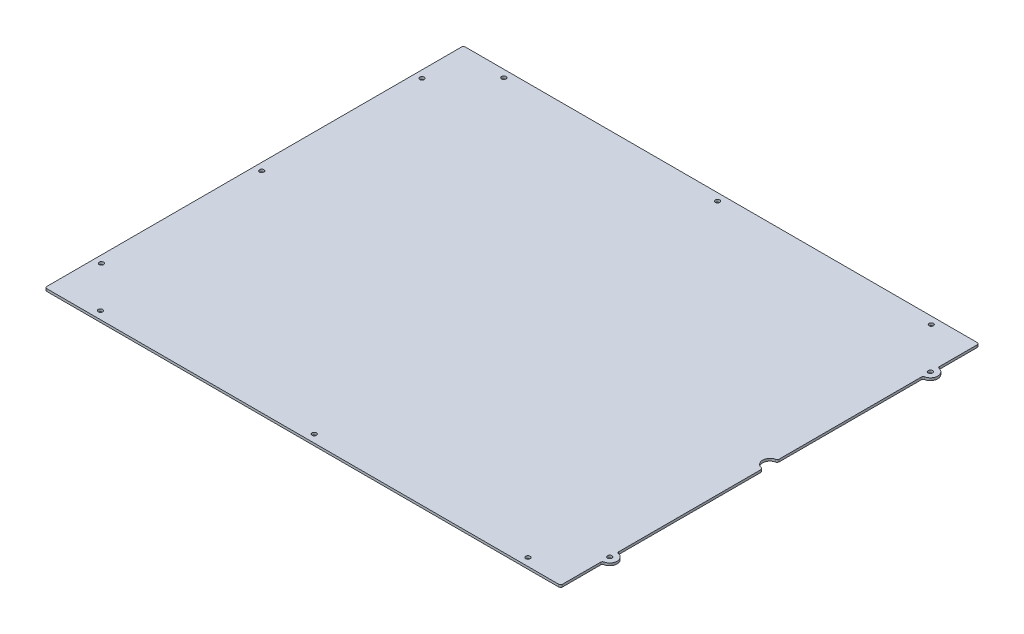
ISO-10303-21;
HEADER;
FILE_DESCRIPTION(('STEP AP214'),'2;1');
FILE_NAME('part.step','',(''),(''),'','','');
FILE_SCHEMA(('AUTOMOTIVE_DESIGN { 1 0 10303 214 1 1 1 1 }'));
ENDSEC;
DATA;
#1=APPLICATION_CONTEXT('core data for automotive mechanical design processes');
#2=APPLICATION_PROTOCOL_DEFINITION('international standard','automotive_design',2000,#1);
#3=PRODUCT_CONTEXT('',#1,'mechanical');
#4=PRODUCT('Part','Part','',(#3));
#5=PRODUCT_RELATED_PRODUCT_CATEGORY('part','',(#4));
#6=PRODUCT_DEFINITION_FORMATION('','',#4);
#7=PRODUCT_DEFINITION_CONTEXT('part definition',#1,'design');
#8=PRODUCT_DEFINITION('design','',#6,#7);
#9=PRODUCT_DEFINITION_SHAPE('','',#8);
#10=(LENGTH_UNIT() NAMED_UNIT(*) SI_UNIT(.MILLI.,.METRE.));
#11=(NAMED_UNIT(*) PLANE_ANGLE_UNIT() SI_UNIT($,.RADIAN.));
#12=(NAMED_UNIT(*) SI_UNIT($,.STERADIAN.) SOLID_ANGLE_UNIT());
#13=UNCERTAINTY_MEASURE_WITH_UNIT(LENGTH_MEASURE(1.E-05),#10,'distance_accuracy_value','');
#14=(GEOMETRIC_REPRESENTATION_CONTEXT(3) GLOBAL_UNCERTAINTY_ASSIGNED_CONTEXT((#13)) GLOBAL_UNIT_ASSIGNED_CONTEXT((#10,
#11,#12)) REPRESENTATION_CONTEXT('',''));
#15=CARTESIAN_POINT('',(0.,0.,0.));
#16=DIRECTION('',(0.,0.,1.));
#17=DIRECTION('',(1.,0.,0.));
#18=AXIS2_PLACEMENT_3D('',#15,#16,#17);
#19=CARTESIAN_POINT('',(-337.058,3.175,-273.558));
#20=DIRECTION('',(0.,0.,1.));
#21=DIRECTION('',(1.,0.,0.));
#22=AXIS2_PLACEMENT_3D('',#19,#20,#21);
#23=PLANE('',#22);
#24=DIRECTION('',(-1.,0.,0.));
#25=VECTOR('',#24,1.);
#26=CARTESIAN_POINT('',(-337.058,0.,-273.558));
#27=LINE('',#26,#25);
#28=CARTESIAN_POINT('',(334.518,0.,-273.558));
#29=VERTEX_POINT('',#28);
#30=CARTESIAN_POINT('',(-334.518,0.,-273.558));
#31=VERTEX_POINT('',#30);
#32=EDGE_CURVE('E198',#29,#31,#27,.T.);
#33=ORIENTED_EDGE('',*,*,#32,.T.);
#34=DIRECTION('',(0.,-1.,0.));
#35=VECTOR('',#34,1.);
#36=CARTESIAN_POINT('',(-334.518,3.175,-273.558));
#37=LINE('',#36,#35);
#38=CARTESIAN_POINT('',(-334.518,3.175,-273.558));
#39=VERTEX_POINT('',#38);
#40=EDGE_CURVE('E176',#31,#39,#37,.F.);
#41=ORIENTED_EDGE('',*,*,#40,.T.);
#42=DIRECTION('',(-1.,0.,0.));
#43=VECTOR('',#42,1.);
#44=CARTESIAN_POINT('',(-337.058,3.175,-273.558));
#45=LINE('',#44,#43);
#46=CARTESIAN_POINT('',(334.518,3.175,-273.558));
#47=VERTEX_POINT('',#46);
#48=EDGE_CURVE('E226',#47,#39,#45,.T.);
#49=ORIENTED_EDGE('',*,*,#48,.F.);
#50=DIRECTION('',(0.,-1.,0.));
#51=VECTOR('',#50,1.);
#52=CARTESIAN_POINT('',(334.518,3.175,-273.558));
#53=LINE('',#52,#51);
#54=EDGE_CURVE('E181',#47,#29,#53,.T.);
#55=ORIENTED_EDGE('',*,*,#54,.T.);
#56=EDGE_LOOP('',(#33,#41,#49,#55));
#57=FACE_BOUND('',#56,.T.);
#58=ADVANCED_FACE('F34',(#57),#23,.F.);
#59=CARTESIAN_POINT('',(-337.058,3.175,273.558));
#60=DIRECTION('',(1.,0.,0.));
#61=DIRECTION('',(0.,0.,-1.));
#62=AXIS2_PLACEMENT_3D('',#59,#60,#61);
#63=PLANE('',#62);
#64=DIRECTION('',(0.,0.,1.));
#65=VECTOR('',#64,1.);
#66=CARTESIAN_POINT('',(-337.058,3.175,273.558));
#67=LINE('',#66,#65);
#68=CARTESIAN_POINT('',(-337.058,3.175,-271.018));
#69=VERTEX_POINT('',#68);
#70=CARTESIAN_POINT('',(-337.058,3.175,271.018));
#71=VERTEX_POINT('',#70);
#72=EDGE_CURVE('E191',#69,#71,#67,.T.);
#73=ORIENTED_EDGE('',*,*,#72,.F.);
#74=DIRECTION('',(0.,-1.,0.));
#75=VECTOR('',#74,1.);
#76=CARTESIAN_POINT('',(-337.058,3.175,-271.018));
#77=LINE('',#76,#75);
#78=CARTESIAN_POINT('',(-337.058,0.,-271.018));
#79=VERTEX_POINT('',#78);
#80=EDGE_CURVE('E175',#69,#79,#77,.T.);
#81=ORIENTED_EDGE('',*,*,#80,.T.);
#82=DIRECTION('',(0.,0.,1.));
#83=VECTOR('',#82,1.);
#84=CARTESIAN_POINT('',(-337.058,0.,273.558));
#85=LINE('',#84,#83);
#86=CARTESIAN_POINT('',(-337.058,0.,271.018));
#87=VERTEX_POINT('',#86);
#88=EDGE_CURVE('E188',#79,#87,#85,.T.);
#89=ORIENTED_EDGE('',*,*,#88,.T.);
#90=DIRECTION('',(0.,-1.,0.));
#91=VECTOR('',#90,1.);
#92=CARTESIAN_POINT('',(-337.058,3.175,271.018));
#93=LINE('',#92,#91);
#94=EDGE_CURVE('E193',#87,#71,#93,.F.);
#95=ORIENTED_EDGE('',*,*,#94,.T.);
#96=EDGE_LOOP('',(#73,#81,#89,#95));
#97=FACE_BOUND('',#96,.T.);
#98=ADVANCED_FACE('F187',(#97),#63,.F.);
#99=CARTESIAN_POINT('',(-337.058,3.175,273.558));
#100=DIRECTION('',(0.,0.,-1.));
#101=DIRECTION('',(-1.,0.,0.));
#102=AXIS2_PLACEMENT_3D('',#99,#100,#101);
#103=PLANE('',#102);
#104=DIRECTION('',(1.,0.,0.));
#105=VECTOR('',#104,1.);
#106=CARTESIAN_POINT('',(-337.058,3.175,273.558));
#107=LINE('',#106,#105);
#108=CARTESIAN_POINT('',(-334.518,3.175,273.558));
#109=VERTEX_POINT('',#108);
#110=CARTESIAN_POINT('',(334.518,3.175,273.558));
#111=VERTEX_POINT('',#110);
#112=EDGE_CURVE('E331',#109,#111,#107,.T.);
#113=ORIENTED_EDGE('',*,*,#112,.F.);
#114=DIRECTION('',(0.,-1.,0.));
#115=VECTOR('',#114,1.);
#116=CARTESIAN_POINT('',(-334.518,3.175,273.558));
#117=LINE('',#116,#115);
#118=CARTESIAN_POINT('',(-334.518,0.,273.558));
#119=VERTEX_POINT('',#118);
#120=EDGE_CURVE('E254',#109,#119,#117,.T.);
#121=ORIENTED_EDGE('',*,*,#120,.T.);
#122=DIRECTION('',(1.,0.,0.));
#123=VECTOR('',#122,1.);
#124=CARTESIAN_POINT('',(-337.058,0.,273.558));
#125=LINE('',#124,#123);
#126=CARTESIAN_POINT('',(334.518,0.,273.558));
#127=VERTEX_POINT('',#126);
#128=EDGE_CURVE('E197',#119,#127,#125,.T.);
#129=ORIENTED_EDGE('',*,*,#128,.T.);
#130=DIRECTION('',(0.,-1.,0.));
#131=VECTOR('',#130,1.);
#132=CARTESIAN_POINT('',(334.518,3.175,273.558));
#133=LINE('',#132,#131);
#134=EDGE_CURVE('E252',#127,#111,#133,.F.);
#135=ORIENTED_EDGE('',*,*,#134,.T.);
#136=EDGE_LOOP('',(#113,#121,#129,#135));
#137=FACE_BOUND('',#136,.T.);
#138=ADVANCED_FACE('F448',(#137),#103,.F.);
#139=CARTESIAN_POINT('',(337.058,3.175,273.558));
#140=DIRECTION('',(-1.,0.,0.));
#141=DIRECTION('',(0.,0.,1.));
#142=AXIS2_PLACEMENT_3D('',#139,#140,#141);
#143=PLANE('',#142);
#144=DIRECTION('',(0.,0.,-1.));
#145=VECTOR('',#144,1.);
#146=CARTESIAN_POINT('',(337.058,3.175,273.558));
#147=LINE('',#146,#145);
#148=CARTESIAN_POINT('',(337.058,3.175,271.018));
#149=VERTEX_POINT('',#148);
#150=CARTESIAN_POINT('',(337.058,3.175,221.220481707814));
#151=VERTEX_POINT('',#150);
#152=EDGE_CURVE('E328',#149,#151,#147,.T.);
#153=ORIENTED_EDGE('',*,*,#152,.F.);
#154=DIRECTION('',(0.,-1.,0.));
#155=VECTOR('',#154,1.);
#156=CARTESIAN_POINT('',(337.058,3.175,271.018));
#157=LINE('',#156,#155);
#158=CARTESIAN_POINT('',(337.058,0.,271.018));
#159=VERTEX_POINT('',#158);
#160=EDGE_CURVE('E259',#149,#159,#157,.T.);
#161=ORIENTED_EDGE('',*,*,#160,.T.);
#162=DIRECTION('',(0.,0.,-1.));
#163=VECTOR('',#162,1.);
#164=CARTESIAN_POINT('',(337.058,0.,273.558));
#165=LINE('',#164,#163);
#166=CARTESIAN_POINT('',(337.058,0.,221.220481707814));
#167=VERTEX_POINT('',#166);
#168=EDGE_CURVE('E201',#159,#167,#165,.T.);
#169=ORIENTED_EDGE('',*,*,#168,.T.);
#170=DIRECTION('',(0.,1.,0.));
#171=VECTOR('',#170,1.);
#172=CARTESIAN_POINT('',(337.058,3.175,221.220481707814));
#173=LINE('',#172,#171);
#174=EDGE_CURVE('E257',#167,#151,#173,.T.);
#175=ORIENTED_EDGE('',*,*,#174,.T.);
#176=EDGE_LOOP('',(#153,#161,#169,#175));
#177=FACE_BOUND('',#176,.T.);
#178=ADVANCED_FACE('F512',(#177),#143,.F.);
#179=CARTESIAN_POINT('',(337.058,3.175,209.296));
#180=DIRECTION('',(0.,-1.,0.));
#181=DIRECTION('',(0.,0.,-1.));
#182=AXIS2_PLACEMENT_3D('',#179,#180,#181);
#183=CYLINDRICAL_SURFACE('',#182,9.65199999999997);
#184=CARTESIAN_POINT('',(337.058,3.175,209.296));
#185=DIRECTION('',(0.,1.,0.));
#186=DIRECTION('',(0.,0.,1.));
#187=AXIS2_PLACEMENT_3D('',#184,#185,#186);
#188=CIRCLE('',#187,9.65199999999997);
#189=CARTESIAN_POINT('',(339.068833333333,3.175,218.736214685353));
#190=VERTEX_POINT('',#189);
#191=CARTESIAN_POINT('',(339.068833333333,3.175,199.855785314647));
#192=VERTEX_POINT('',#191);
#193=EDGE_CURVE('E325',#190,#192,#188,.T.);
#194=ORIENTED_EDGE('',*,*,#193,.F.);
#195=DIRECTION('',(0.,-1.,0.));
#196=VECTOR('',#195,1.);
#197=CARTESIAN_POINT('',(339.068833333333,3.175,218.736214685353));
#198=LINE('',#197,#196);
#199=CARTESIAN_POINT('',(339.068833333333,0.,218.736214685353));
#200=VERTEX_POINT('',#199);
#201=EDGE_CURVE('E264',#190,#200,#198,.T.);
#202=ORIENTED_EDGE('',*,*,#201,.T.);
#203=CARTESIAN_POINT('',(337.058,0.,209.296));
#204=DIRECTION('',(0.,1.,0.));
#205=DIRECTION('',(0.,0.,1.));
#206=AXIS2_PLACEMENT_3D('',#203,#204,#205);
#207=CIRCLE('',#206,9.65199999999997);
#208=CARTESIAN_POINT('',(339.068833333333,0.,199.855785314647));
#209=VERTEX_POINT('',#208);
#210=EDGE_CURVE('E209',#200,#209,#207,.T.);
#211=ORIENTED_EDGE('',*,*,#210,.T.);
#212=DIRECTION('',(0.,-1.,0.));
#213=VECTOR('',#212,1.);
#214=CARTESIAN_POINT('',(339.068833333333,3.175,199.855785314647));
#215=LINE('',#214,#213);
#216=EDGE_CURVE('E262',#209,#192,#215,.F.);
#217=ORIENTED_EDGE('',*,*,#216,.T.);
#218=EDGE_LOOP('',(#194,#202,#211,#217));
#219=FACE_BOUND('',#218,.T.);
#220=ADVANCED_FACE('F505',(#219),#183,.T.);
#221=CARTESIAN_POINT('',(337.058,3.175,199.644));
#222=DIRECTION('',(-1.,0.,0.));
#223=DIRECTION('',(0.,0.,1.));
#224=AXIS2_PLACEMENT_3D('',#221,#222,#223);
#225=PLANE('',#224);
#226=DIRECTION('',(0.,0.,-1.));
#227=VECTOR('',#226,1.);
#228=CARTESIAN_POINT('',(337.058,3.175,199.644));
#229=LINE('',#228,#227);
#230=CARTESIAN_POINT('',(337.058,3.175,197.371518292186));
#231=VERTEX_POINT('',#230);
#232=CARTESIAN_POINT('',(337.058,3.175,11.6704817078144));
#233=VERTEX_POINT('',#232);
#234=EDGE_CURVE('E322',#231,#233,#229,.T.);
#235=ORIENTED_EDGE('',*,*,#234,.F.);
#236=DIRECTION('',(0.,1.,0.));
#237=VECTOR('',#236,1.);
#238=CARTESIAN_POINT('',(337.058,0.,197.371518292186));
#239=LINE('',#238,#237);
#240=CARTESIAN_POINT('',(337.058,0.,197.371518292186));
#241=VERTEX_POINT('',#240);
#242=EDGE_CURVE('E269',#231,#241,#239,.F.);
#243=ORIENTED_EDGE('',*,*,#242,.T.);
#244=DIRECTION('',(0.,0.,-1.));
#245=VECTOR('',#244,1.);
#246=CARTESIAN_POINT('',(337.058,0.,199.644));
#247=LINE('',#246,#245);
#248=CARTESIAN_POINT('',(337.058,0.,11.6704817078144));
#249=VERTEX_POINT('',#248);
#250=EDGE_CURVE('E212',#241,#249,#247,.T.);
#251=ORIENTED_EDGE('',*,*,#250,.T.);
#252=DIRECTION('',(0.,-1.,0.));
#253=VECTOR('',#252,1.);
#254=CARTESIAN_POINT('',(337.058,3.175,11.6704817078144));
#255=LINE('',#254,#253);
#256=EDGE_CURVE('E267',#249,#233,#255,.F.);
#257=ORIENTED_EDGE('',*,*,#256,.T.);
#258=EDGE_LOOP('',(#235,#243,#251,#257));
#259=FACE_BOUND('',#258,.T.);
#260=ADVANCED_FACE('F498',(#259),#225,.F.);
#261=CARTESIAN_POINT('',(337.058,3.175,-0.254000000000004));
#262=DIRECTION('',(0.,-1.,0.));
#263=DIRECTION('',(0.,0.,-1.));
#264=AXIS2_PLACEMENT_3D('',#261,#262,#263);
#265=CYLINDRICAL_SURFACE('',#264,9.65199999999998);
#266=CARTESIAN_POINT('',(337.058,3.175,-0.254000000000004));
#267=DIRECTION('',(0.,-1.,0.));
#268=DIRECTION('',(0.,0.,1.));
#269=AXIS2_PLACEMENT_3D('',#266,#267,#268);
#270=CIRCLE('',#269,9.65199999999998);
#271=CARTESIAN_POINT('',(335.047166666667,3.175,9.18621468535305));
#272=VERTEX_POINT('',#271);
#273=CARTESIAN_POINT('',(335.047166666667,3.175,-9.69421468535305));
#274=VERTEX_POINT('',#273);
#275=EDGE_CURVE('E319',#272,#274,#270,.T.);
#276=ORIENTED_EDGE('',*,*,#275,.F.);
#277=DIRECTION('',(0.,-1.,0.));
#278=VECTOR('',#277,1.);
#279=CARTESIAN_POINT('',(335.047166666667,3.175,9.18621468535304));
#280=LINE('',#279,#278);
#281=CARTESIAN_POINT('',(335.047166666667,0.,9.18621468535305));
#282=VERTEX_POINT('',#281);
#283=EDGE_CURVE('E274',#272,#282,#280,.T.);
#284=ORIENTED_EDGE('',*,*,#283,.T.);
#285=CARTESIAN_POINT('',(337.058,0.,-0.254000000000004));
#286=DIRECTION('',(0.,-1.,0.));
#287=DIRECTION('',(0.,0.,1.));
#288=AXIS2_PLACEMENT_3D('',#285,#286,#287);
#289=CIRCLE('',#288,9.65199999999998);
#290=CARTESIAN_POINT('',(335.047166666667,0.,-9.69421468535305));
#291=VERTEX_POINT('',#290);
#292=EDGE_CURVE('E215',#282,#291,#289,.T.);
#293=ORIENTED_EDGE('',*,*,#292,.T.);
#294=DIRECTION('',(0.,-1.,0.));
#295=VECTOR('',#294,1.);
#296=CARTESIAN_POINT('',(335.047166666667,3.175,-9.69421468535305));
#297=LINE('',#296,#295);
#298=EDGE_CURVE('E272',#291,#274,#297,.F.);
#299=ORIENTED_EDGE('',*,*,#298,.T.);
#300=EDGE_LOOP('',(#276,#284,#293,#299));
#301=FACE_BOUND('',#300,.T.);
#302=ADVANCED_FACE('F491',(#301),#265,.F.);
#303=CARTESIAN_POINT('',(337.058,3.175,-9.90599999999999));
#304=DIRECTION('',(-1.,0.,0.));
#305=DIRECTION('',(0.,0.,1.));
#306=AXIS2_PLACEMENT_3D('',#303,#304,#305);
#307=PLANE('',#306);
#308=DIRECTION('',(0.,0.,-1.));
#309=VECTOR('',#308,1.);
#310=CARTESIAN_POINT('',(337.058,3.175,-9.90599999999999));
#311=LINE('',#310,#309);
#312=CARTESIAN_POINT('',(337.058,3.175,-12.1784817078144));
#313=VERTEX_POINT('',#312);
#314=CARTESIAN_POINT('',(337.058,3.175,-197.879518292186));
#315=VERTEX_POINT('',#314);
#316=EDGE_CURVE('E314',#313,#315,#311,.T.);
#317=ORIENTED_EDGE('',*,*,#316,.F.);
#318=DIRECTION('',(0.,-1.,0.));
#319=VECTOR('',#318,1.);
#320=CARTESIAN_POINT('',(337.058,3.175,-12.1784817078144));
#321=LINE('',#320,#319);
#322=CARTESIAN_POINT('',(337.058,0.,-12.1784817078144));
#323=VERTEX_POINT('',#322);
#324=EDGE_CURVE('E279',#313,#323,#321,.T.);
#325=ORIENTED_EDGE('',*,*,#324,.T.);
#326=DIRECTION('',(0.,0.,-1.));
#327=VECTOR('',#326,1.);
#328=CARTESIAN_POINT('',(337.058,0.,-9.90599999999999));
#329=LINE('',#328,#327);
#330=CARTESIAN_POINT('',(337.058,0.,-197.879518292186));
#331=VERTEX_POINT('',#330);
#332=EDGE_CURVE('E218',#323,#331,#329,.T.);
#333=ORIENTED_EDGE('',*,*,#332,.T.);
#334=DIRECTION('',(0.,1.,0.));
#335=VECTOR('',#334,1.);
#336=CARTESIAN_POINT('',(337.058,3.175,-197.879518292186));
#337=LINE('',#336,#335);
#338=EDGE_CURVE('E277',#331,#315,#337,.T.);
#339=ORIENTED_EDGE('',*,*,#338,.T.);
#340=EDGE_LOOP('',(#317,#325,#333,#339));
#341=FACE_BOUND('',#340,.T.);
#342=ADVANCED_FACE('F486',(#341),#307,.F.);
#343=CARTESIAN_POINT('',(337.058,3.175,-209.804));
#344=DIRECTION('',(0.,-1.,0.));
#345=DIRECTION('',(0.,0.,-1.));
#346=AXIS2_PLACEMENT_3D('',#343,#344,#345);
#347=CYLINDRICAL_SURFACE('',#346,9.65199999999997);
#348=CARTESIAN_POINT('',(337.058,3.175,-209.804));
#349=DIRECTION('',(0.,1.,0.));
#350=DIRECTION('',(0.,0.,1.));
#351=AXIS2_PLACEMENT_3D('',#348,#349,#350);
#352=CIRCLE('',#351,9.65199999999997);
#353=CARTESIAN_POINT('',(339.068833333333,3.175,-200.363785314647));
#354=VERTEX_POINT('',#353);
#355=CARTESIAN_POINT('',(339.068833333333,3.175,-219.244214685353));
#356=VERTEX_POINT('',#355);
#357=EDGE_CURVE('E313',#354,#356,#352,.T.);
#358=ORIENTED_EDGE('',*,*,#357,.F.);
#359=DIRECTION('',(0.,-1.,0.));
#360=VECTOR('',#359,1.);
#361=CARTESIAN_POINT('',(339.068833333333,3.175,-200.363785314647));
#362=LINE('',#361,#360);
#363=CARTESIAN_POINT('',(339.068833333333,0.,-200.363785314647));
#364=VERTEX_POINT('',#363);
#365=EDGE_CURVE('E284',#354,#364,#362,.T.);
#366=ORIENTED_EDGE('',*,*,#365,.T.);
#367=CARTESIAN_POINT('',(337.058,0.,-209.804));
#368=DIRECTION('',(0.,1.,0.));
#369=DIRECTION('',(0.,0.,1.));
#370=AXIS2_PLACEMENT_3D('',#367,#368,#369);
#371=CIRCLE('',#370,9.65199999999997);
#372=CARTESIAN_POINT('',(339.068833333333,0.,-219.244214685353));
#373=VERTEX_POINT('',#372);
#374=EDGE_CURVE('E221',#364,#373,#371,.T.);
#375=ORIENTED_EDGE('',*,*,#374,.T.);
#376=DIRECTION('',(0.,-1.,0.));
#377=VECTOR('',#376,1.);
#378=CARTESIAN_POINT('',(339.068833333333,3.175,-219.244214685353));
#379=LINE('',#378,#377);
#380=EDGE_CURVE('E282',#373,#356,#379,.F.);
#381=ORIENTED_EDGE('',*,*,#380,.T.);
#382=EDGE_LOOP('',(#358,#366,#375,#381));
#383=FACE_BOUND('',#382,.T.);
#384=ADVANCED_FACE('F309',(#383),#347,.T.);
#385=CARTESIAN_POINT('',(337.058,3.175,-219.456));
#386=DIRECTION('',(-1.,0.,0.));
#387=DIRECTION('',(0.,0.,1.));
#388=AXIS2_PLACEMENT_3D('',#385,#386,#387);
#389=PLANE('',#388);
#390=DIRECTION('',(0.,0.,-1.));
#391=VECTOR('',#390,1.);
#392=CARTESIAN_POINT('',(337.058,0.,-219.456));
#393=LINE('',#392,#391);
#394=CARTESIAN_POINT('',(337.058,0.,-221.728481707814));
#395=VERTEX_POINT('',#394);
#396=CARTESIAN_POINT('',(337.058,0.,-271.018));
#397=VERTEX_POINT('',#396);
#398=EDGE_CURVE('E224',#395,#397,#393,.T.);
#399=ORIENTED_EDGE('',*,*,#398,.T.);
#400=DIRECTION('',(0.,-1.,0.));
#401=VECTOR('',#400,1.);
#402=CARTESIAN_POINT('',(337.058,3.175,-271.018));
#403=LINE('',#402,#401);
#404=CARTESIAN_POINT('',(337.058,3.175,-271.018));
#405=VERTEX_POINT('',#404);
#406=EDGE_CURVE('E49',#397,#405,#403,.F.);
#407=ORIENTED_EDGE('',*,*,#406,.T.);
#408=DIRECTION('',(0.,0.,-1.));
#409=VECTOR('',#408,1.);
#410=CARTESIAN_POINT('',(337.058,3.175,-219.456));
#411=LINE('',#410,#409);
#412=CARTESIAN_POINT('',(337.058,3.175,-221.728481707814));
#413=VERTEX_POINT('',#412);
#414=EDGE_CURVE('E227',#413,#405,#411,.T.);
#415=ORIENTED_EDGE('',*,*,#414,.F.);
#416=DIRECTION('',(0.,1.,0.));
#417=VECTOR('',#416,1.);
#418=CARTESIAN_POINT('',(337.058,0.,-221.728481707814));
#419=LINE('',#418,#417);
#420=EDGE_CURVE('E287',#413,#395,#419,.F.);
#421=ORIENTED_EDGE('',*,*,#420,.T.);
#422=EDGE_LOOP('',(#399,#407,#415,#421));
#423=FACE_BOUND('',#422,.T.);
#424=ADVANCED_FACE('F311',(#423),#389,.F.);
#425=CARTESIAN_POINT('',(337.058,3.175,-209.804));
#426=DIRECTION('',(0.,1.,0.));
#427=DIRECTION('',(0.,0.,1.));
#428=AXIS2_PLACEMENT_3D('',#425,#426,#427);
#429=PLANE('',#428);
#430=CARTESIAN_POINT('',(-274.573999999999,3.175,-263.906));
#431=DIRECTION('',(0.,1.,0.));
#432=DIRECTION('',(0.,0.,1.));
#433=AXIS2_PLACEMENT_3D('',#430,#431,#432);
#434=CIRCLE('',#433,2.8956);
#435=CARTESIAN_POINT('',(-274.573999999999,3.175,-261.0104));
#436=VERTEX_POINT('',#435);
#437=EDGE_CURVE('E399',#436,#436,#434,.T.);
#438=ORIENTED_EDGE('',*,*,#437,.F.);
#439=EDGE_LOOP('',(#438));
#440=FACE_BOUND('',#439,.T.);
#441=CARTESIAN_POINT('',(-327.406,3.175,-209.804));
#442=DIRECTION('',(0.,1.,0.));
#443=DIRECTION('',(0.,0.,1.));
#444=AXIS2_PLACEMENT_3D('',#441,#442,#443);
#445=CIRCLE('',#444,2.8956);
#446=CARTESIAN_POINT('',(-327.406,3.175,-206.9084));
#447=VERTEX_POINT('',#446);
#448=EDGE_CURVE('E393',#447,#447,#445,.T.);
#449=ORIENTED_EDGE('',*,*,#448,.F.);
#450=EDGE_LOOP('',(#449));
#451=FACE_BOUND('',#450,.T.);
#452=CARTESIAN_POINT('',(4.82600000000061,3.175,-263.906));
#453=DIRECTION('',(0.,1.,0.));
#454=DIRECTION('',(0.,0.,1.));
#455=AXIS2_PLACEMENT_3D('',#452,#453,#454);
#456=CIRCLE('',#455,2.89559999999999);
#457=CARTESIAN_POINT('',(4.82600000000061,3.175,-261.0104));
#458=VERTEX_POINT('',#457);
#459=EDGE_CURVE('E387',#458,#458,#456,.T.);
#460=ORIENTED_EDGE('',*,*,#459,.F.);
#461=EDGE_LOOP('',(#460));
#462=FACE_BOUND('',#461,.T.);
#463=CARTESIAN_POINT('',(284.226000000001,3.175,-263.906));
#464=DIRECTION('',(0.,1.,0.));
#465=DIRECTION('',(0.,0.,1.));
#466=AXIS2_PLACEMENT_3D('',#463,#464,#465);
#467=CIRCLE('',#466,2.8956);
#468=CARTESIAN_POINT('',(284.226000000001,3.175,-261.0104));
#469=VERTEX_POINT('',#468);
#470=EDGE_CURVE('E381',#469,#469,#467,.T.);
#471=ORIENTED_EDGE('',*,*,#470,.F.);
#472=EDGE_LOOP('',(#471));
#473=FACE_BOUND('',#472,.T.);
#474=CARTESIAN_POINT('',(284.226,3.175,263.398));
#475=DIRECTION('',(0.,1.,0.));
#476=DIRECTION('',(0.,0.,1.));
#477=AXIS2_PLACEMENT_3D('',#474,#475,#476);
#478=CIRCLE('',#477,2.8956);
#479=CARTESIAN_POINT('',(284.226,3.175,266.2936));
#480=VERTEX_POINT('',#479);
#481=EDGE_CURVE('E375',#480,#480,#478,.T.);
#482=ORIENTED_EDGE('',*,*,#481,.F.);
#483=EDGE_LOOP('',(#482));
#484=FACE_BOUND('',#483,.T.);
#485=CARTESIAN_POINT('',(4.82600000000039,3.175,263.398));
#486=DIRECTION('',(0.,1.,0.));
#487=DIRECTION('',(0.,0.,1.));
#488=AXIS2_PLACEMENT_3D('',#485,#486,#487);
#489=CIRCLE('',#488,2.89559999999999);
#490=CARTESIAN_POINT('',(4.82600000000039,3.175,266.2936));
#491=VERTEX_POINT('',#490);
#492=EDGE_CURVE('E369',#491,#491,#489,.T.);
#493=ORIENTED_EDGE('',*,*,#492,.F.);
#494=EDGE_LOOP('',(#493));
#495=FACE_BOUND('',#494,.T.);
#496=CARTESIAN_POINT('',(-274.574,3.175,263.398));
#497=DIRECTION('',(0.,1.,0.));
#498=DIRECTION('',(0.,0.,1.));
#499=AXIS2_PLACEMENT_3D('',#496,#497,#498);
#500=CIRCLE('',#499,2.8956);
#501=CARTESIAN_POINT('',(-274.574,3.175,266.2936));
#502=VERTEX_POINT('',#501);
#503=EDGE_CURVE('E363',#502,#502,#500,.T.);
#504=ORIENTED_EDGE('',*,*,#503,.F.);
#505=EDGE_LOOP('',(#504));
#506=FACE_BOUND('',#505,.T.);
#507=CARTESIAN_POINT('',(-327.406,3.175,209.296));
#508=DIRECTION('',(0.,1.,0.));
#509=DIRECTION('',(0.,0.,1.));
#510=AXIS2_PLACEMENT_3D('',#507,#508,#509);
#511=CIRCLE('',#510,2.8956);
#512=CARTESIAN_POINT('',(-327.406,3.175,212.1916));
#513=VERTEX_POINT('',#512);
#514=EDGE_CURVE('E357',#513,#513,#511,.T.);
#515=ORIENTED_EDGE('',*,*,#514,.F.);
#516=EDGE_LOOP('',(#515));
#517=FACE_BOUND('',#516,.T.);
#518=CARTESIAN_POINT('',(-327.406,3.175,-0.25400000000031));
#519=DIRECTION('',(0.,1.,0.));
#520=DIRECTION('',(0.,0.,1.));
#521=AXIS2_PLACEMENT_3D('',#518,#519,#520);
#522=CIRCLE('',#521,2.8956);
#523=CARTESIAN_POINT('',(-327.406,3.175,2.64159999999969));
#524=VERTEX_POINT('',#523);
#525=EDGE_CURVE('E351',#524,#524,#522,.T.);
#526=ORIENTED_EDGE('',*,*,#525,.F.);
#527=EDGE_LOOP('',(#526));
#528=FACE_BOUND('',#527,.T.);
#529=CARTESIAN_POINT('',(337.058,3.175,-209.804));
#530=DIRECTION('',(0.,1.,0.));
#531=DIRECTION('',(0.,0.,1.));
#532=AXIS2_PLACEMENT_3D('',#529,#530,#531);
#533=CIRCLE('',#532,2.8956);
#534=CARTESIAN_POINT('',(337.058,3.175,-206.9084));
#535=VERTEX_POINT('',#534);
#536=EDGE_CURVE('E345',#535,#535,#533,.T.);
#537=ORIENTED_EDGE('',*,*,#536,.F.);
#538=EDGE_LOOP('',(#537));
#539=FACE_BOUND('',#538,.T.);
#540=CARTESIAN_POINT('',(337.058,3.175,209.296));
#541=DIRECTION('',(0.,1.,0.));
#542=DIRECTION('',(0.,0.,1.));
#543=AXIS2_PLACEMENT_3D('',#540,#541,#542);
#544=CIRCLE('',#543,2.8956);
#545=CARTESIAN_POINT('',(337.058,3.175,212.1916));
#546=VERTEX_POINT('',#545);
#547=EDGE_CURVE('E339',#546,#546,#544,.T.);
#548=ORIENTED_EDGE('',*,*,#547,.F.);
#549=EDGE_LOOP('',(#548));
#550=FACE_BOUND('',#549,.T.);
#551=ORIENTED_EDGE('',*,*,#48,.T.);
#552=CARTESIAN_POINT('',(-334.518,3.175,-271.018));
#553=DIRECTION('',(0.,1.,0.));
#554=DIRECTION('',(0.,0.,1.));
#555=AXIS2_PLACEMENT_3D('',#552,#553,#554);
#556=CIRCLE('',#555,2.54);
#557=EDGE_CURVE('E250',#39,#69,#556,.T.);
#558=ORIENTED_EDGE('',*,*,#557,.T.);
#559=ORIENTED_EDGE('',*,*,#72,.T.);
#560=CARTESIAN_POINT('',(-334.518,3.175,271.018));
#561=DIRECTION('',(0.,1.,0.));
#562=DIRECTION('',(0.,0.,1.));
#563=AXIS2_PLACEMENT_3D('',#560,#561,#562);
#564=CIRCLE('',#563,2.54);
#565=EDGE_CURVE('E248',#71,#109,#564,.T.);
#566=ORIENTED_EDGE('',*,*,#565,.T.);
#567=ORIENTED_EDGE('',*,*,#112,.T.);
#568=CARTESIAN_POINT('',(334.518,3.175,271.018));
#569=DIRECTION('',(0.,1.,0.));
#570=DIRECTION('',(0.,0.,1.));
#571=AXIS2_PLACEMENT_3D('',#568,#569,#570);
#572=CIRCLE('',#571,2.54);
#573=EDGE_CURVE('E246',#111,#149,#572,.T.);
#574=ORIENTED_EDGE('',*,*,#573,.T.);
#575=ORIENTED_EDGE('',*,*,#152,.T.);
#576=CARTESIAN_POINT('',(339.598,3.175,221.220481707814));
#577=DIRECTION('',(0.,1.,0.));
#578=DIRECTION('',(0.,0.,1.));
#579=AXIS2_PLACEMENT_3D('',#576,#577,#578);
#580=CIRCLE('',#579,2.54);
#581=EDGE_CURVE('E293',#151,#190,#580,.F.);
#582=ORIENTED_EDGE('',*,*,#581,.T.);
#583=ORIENTED_EDGE('',*,*,#193,.T.);
#584=CARTESIAN_POINT('',(339.598,3.175,197.371518292186));
#585=DIRECTION('',(0.,1.,0.));
#586=DIRECTION('',(0.,0.,1.));
#587=AXIS2_PLACEMENT_3D('',#584,#585,#586);
#588=CIRCLE('',#587,2.54);
#589=EDGE_CURVE('E297',#192,#231,#588,.F.);
#590=ORIENTED_EDGE('',*,*,#589,.T.);
#591=ORIENTED_EDGE('',*,*,#234,.T.);
#592=CARTESIAN_POINT('',(334.518,3.175,11.6704817078144));
#593=DIRECTION('',(0.,1.,0.));
#594=DIRECTION('',(0.,0.,1.));
#595=AXIS2_PLACEMENT_3D('',#592,#593,#594);
#596=CIRCLE('',#595,2.54);
#597=EDGE_CURVE('E244',#233,#272,#596,.T.);
#598=ORIENTED_EDGE('',*,*,#597,.T.);
#599=ORIENTED_EDGE('',*,*,#275,.T.);
#600=CARTESIAN_POINT('',(334.518,3.175,-12.1784817078144));
#601=DIRECTION('',(0.,1.,0.));
#602=DIRECTION('',(0.,0.,1.));
#603=AXIS2_PLACEMENT_3D('',#600,#601,#602);
#604=CIRCLE('',#603,2.54);
#605=EDGE_CURVE('E242',#274,#313,#604,.T.);
#606=ORIENTED_EDGE('',*,*,#605,.T.);
#607=ORIENTED_EDGE('',*,*,#316,.T.);
#608=CARTESIAN_POINT('',(339.598,3.175,-197.879518292186));
#609=DIRECTION('',(0.,1.,0.));
#610=DIRECTION('',(0.,0.,1.));
#611=AXIS2_PLACEMENT_3D('',#608,#609,#610);
#612=CIRCLE('',#611,2.54);
#613=EDGE_CURVE('E301',#315,#354,#612,.F.);
#614=ORIENTED_EDGE('',*,*,#613,.T.);
#615=ORIENTED_EDGE('',*,*,#357,.T.);
#616=CARTESIAN_POINT('',(339.598,3.175,-221.728481707814));
#617=DIRECTION('',(0.,1.,0.));
#618=DIRECTION('',(0.,0.,1.));
#619=AXIS2_PLACEMENT_3D('',#616,#617,#618);
#620=CIRCLE('',#619,2.54);
#621=EDGE_CURVE('E11',#356,#413,#620,.F.);
#622=ORIENTED_EDGE('',*,*,#621,.T.);
#623=ORIENTED_EDGE('',*,*,#414,.T.);
#624=CARTESIAN_POINT('',(334.518,3.175,-271.018));
#625=DIRECTION('',(0.,1.,0.));
#626=DIRECTION('',(0.,0.,1.));
#627=AXIS2_PLACEMENT_3D('',#624,#625,#626);
#628=CIRCLE('',#627,2.54);
#629=EDGE_CURVE('E240',#405,#47,#628,.T.);
#630=ORIENTED_EDGE('',*,*,#629,.T.);
#631=EDGE_LOOP('',(#551,#558,#559,#566,#567,#574,#575,#582,#583,#590,#591,#598,#599,#606,#607,
#614,#615,#622,#623,#630));
#632=FACE_BOUND('',#631,.T.);
#633=ADVANCED_FACE('F405',(#440,#451,#462,#473,#484,#495,#506,#517,#528,#539,#550,#632),#429,.T.);
#634=CARTESIAN_POINT('',(337.058,0.,-209.804));
#635=DIRECTION('',(0.,1.,0.));
#636=DIRECTION('',(0.,0.,1.));
#637=AXIS2_PLACEMENT_3D('',#634,#635,#636);
#638=PLANE('',#637);
#639=CARTESIAN_POINT('',(-274.573999999999,0.,-263.906));
#640=DIRECTION('',(0.,1.,0.));
#641=DIRECTION('',(0.,0.,1.));
#642=AXIS2_PLACEMENT_3D('',#639,#640,#641);
#643=CIRCLE('',#642,2.8956);
#644=CARTESIAN_POINT('',(-274.573999999999,0.,-261.0104));
#645=VERTEX_POINT('',#644);
#646=EDGE_CURVE('E396',#645,#645,#643,.T.);
#647=ORIENTED_EDGE('',*,*,#646,.T.);
#648=EDGE_LOOP('',(#647));
#649=FACE_BOUND('',#648,.T.);
#650=CARTESIAN_POINT('',(-327.406,0.,-209.804));
#651=DIRECTION('',(0.,1.,0.));
#652=DIRECTION('',(0.,0.,1.));
#653=AXIS2_PLACEMENT_3D('',#650,#651,#652);
#654=CIRCLE('',#653,2.8956);
#655=CARTESIAN_POINT('',(-327.406,0.,-206.9084));
#656=VERTEX_POINT('',#655);
#657=EDGE_CURVE('E390',#656,#656,#654,.T.);
#658=ORIENTED_EDGE('',*,*,#657,.T.);
#659=EDGE_LOOP('',(#658));
#660=FACE_BOUND('',#659,.T.);
#661=CARTESIAN_POINT('',(4.82600000000061,0.,-263.906));
#662=DIRECTION('',(0.,1.,0.));
#663=DIRECTION('',(0.,0.,1.));
#664=AXIS2_PLACEMENT_3D('',#661,#662,#663);
#665=CIRCLE('',#664,2.8956);
#666=CARTESIAN_POINT('',(4.82600000000061,0.,-261.0104));
#667=VERTEX_POINT('',#666);
#668=EDGE_CURVE('E384',#667,#667,#665,.T.);
#669=ORIENTED_EDGE('',*,*,#668,.T.);
#670=EDGE_LOOP('',(#669));
#671=FACE_BOUND('',#670,.T.);
#672=CARTESIAN_POINT('',(284.226000000001,0.,-263.906));
#673=DIRECTION('',(0.,1.,0.));
#674=DIRECTION('',(0.,0.,1.));
#675=AXIS2_PLACEMENT_3D('',#672,#673,#674);
#676=CIRCLE('',#675,2.8956);
#677=CARTESIAN_POINT('',(284.226000000001,0.,-261.0104));
#678=VERTEX_POINT('',#677);
#679=EDGE_CURVE('E378',#678,#678,#676,.T.);
#680=ORIENTED_EDGE('',*,*,#679,.T.);
#681=EDGE_LOOP('',(#680));
#682=FACE_BOUND('',#681,.T.);
#683=CARTESIAN_POINT('',(284.226,0.,263.398));
#684=DIRECTION('',(0.,1.,0.));
#685=DIRECTION('',(0.,0.,1.));
#686=AXIS2_PLACEMENT_3D('',#683,#684,#685);
#687=CIRCLE('',#686,2.8956);
#688=CARTESIAN_POINT('',(284.226,0.,266.2936));
#689=VERTEX_POINT('',#688);
#690=EDGE_CURVE('E372',#689,#689,#687,.T.);
#691=ORIENTED_EDGE('',*,*,#690,.T.);
#692=EDGE_LOOP('',(#691));
#693=FACE_BOUND('',#692,.T.);
#694=CARTESIAN_POINT('',(4.82600000000039,0.,263.398));
#695=DIRECTION('',(0.,1.,0.));
#696=DIRECTION('',(0.,0.,1.));
#697=AXIS2_PLACEMENT_3D('',#694,#695,#696);
#698=CIRCLE('',#697,2.8956);
#699=CARTESIAN_POINT('',(4.82600000000039,0.,266.2936));
#700=VERTEX_POINT('',#699);
#701=EDGE_CURVE('E366',#700,#700,#698,.T.);
#702=ORIENTED_EDGE('',*,*,#701,.T.);
#703=EDGE_LOOP('',(#702));
#704=FACE_BOUND('',#703,.T.);
#705=CARTESIAN_POINT('',(-274.574,0.,263.398));
#706=DIRECTION('',(0.,1.,0.));
#707=DIRECTION('',(0.,0.,1.));
#708=AXIS2_PLACEMENT_3D('',#705,#706,#707);
#709=CIRCLE('',#708,2.8956);
#710=CARTESIAN_POINT('',(-274.574,0.,266.2936));
#711=VERTEX_POINT('',#710);
#712=EDGE_CURVE('E360',#711,#711,#709,.T.);
#713=ORIENTED_EDGE('',*,*,#712,.T.);
#714=EDGE_LOOP('',(#713));
#715=FACE_BOUND('',#714,.T.);
#716=CARTESIAN_POINT('',(-327.406,0.,209.296));
#717=DIRECTION('',(0.,1.,0.));
#718=DIRECTION('',(0.,0.,1.));
#719=AXIS2_PLACEMENT_3D('',#716,#717,#718);
#720=CIRCLE('',#719,2.8956);
#721=CARTESIAN_POINT('',(-327.406,0.,212.1916));
#722=VERTEX_POINT('',#721);
#723=EDGE_CURVE('E354',#722,#722,#720,.T.);
#724=ORIENTED_EDGE('',*,*,#723,.T.);
#725=EDGE_LOOP('',(#724));
#726=FACE_BOUND('',#725,.T.);
#727=CARTESIAN_POINT('',(-327.406,0.,-0.25400000000031));
#728=DIRECTION('',(0.,1.,0.));
#729=DIRECTION('',(0.,0.,1.));
#730=AXIS2_PLACEMENT_3D('',#727,#728,#729);
#731=CIRCLE('',#730,2.8956);
#732=CARTESIAN_POINT('',(-327.406,0.,2.64159999999969));
#733=VERTEX_POINT('',#732);
#734=EDGE_CURVE('E348',#733,#733,#731,.T.);
#735=ORIENTED_EDGE('',*,*,#734,.T.);
#736=EDGE_LOOP('',(#735));
#737=FACE_BOUND('',#736,.T.);
#738=CARTESIAN_POINT('',(337.058,0.,-209.804));
#739=DIRECTION('',(0.,1.,0.));
#740=DIRECTION('',(0.,0.,1.));
#741=AXIS2_PLACEMENT_3D('',#738,#739,#740);
#742=CIRCLE('',#741,2.8956);
#743=CARTESIAN_POINT('',(337.058,0.,-206.9084));
#744=VERTEX_POINT('',#743);
#745=EDGE_CURVE('E342',#744,#744,#742,.T.);
#746=ORIENTED_EDGE('',*,*,#745,.T.);
#747=EDGE_LOOP('',(#746));
#748=FACE_BOUND('',#747,.T.);
#749=CARTESIAN_POINT('',(337.058,0.,209.296));
#750=DIRECTION('',(0.,1.,0.));
#751=DIRECTION('',(0.,0.,1.));
#752=AXIS2_PLACEMENT_3D('',#749,#750,#751);
#753=CIRCLE('',#752,2.8956);
#754=CARTESIAN_POINT('',(337.058,0.,212.1916));
#755=VERTEX_POINT('',#754);
#756=EDGE_CURVE('E203',#755,#755,#753,.T.);
#757=ORIENTED_EDGE('',*,*,#756,.T.);
#758=EDGE_LOOP('',(#757));
#759=FACE_BOUND('',#758,.T.);
#760=ORIENTED_EDGE('',*,*,#88,.F.);
#761=CARTESIAN_POINT('',(-334.518,0.,-271.018));
#762=DIRECTION('',(0.,1.,0.));
#763=DIRECTION('',(0.,0.,1.));
#764=AXIS2_PLACEMENT_3D('',#761,#762,#763);
#765=CIRCLE('',#764,2.54);
#766=EDGE_CURVE('E171',#79,#31,#765,.F.);
#767=ORIENTED_EDGE('',*,*,#766,.T.);
#768=ORIENTED_EDGE('',*,*,#32,.F.);
#769=CARTESIAN_POINT('',(334.518,0.,-271.018));
#770=DIRECTION('',(0.,1.,0.));
#771=DIRECTION('',(0.,0.,1.));
#772=AXIS2_PLACEMENT_3D('',#769,#770,#771);
#773=CIRCLE('',#772,2.54);
#774=EDGE_CURVE('E192',#29,#397,#773,.F.);
#775=ORIENTED_EDGE('',*,*,#774,.T.);
#776=ORIENTED_EDGE('',*,*,#398,.F.);
#777=CARTESIAN_POINT('',(339.598,0.,-221.728481707814));
#778=DIRECTION('',(0.,1.,0.));
#779=DIRECTION('',(0.,0.,1.));
#780=AXIS2_PLACEMENT_3D('',#777,#778,#779);
#781=CIRCLE('',#780,2.54);
#782=EDGE_CURVE('E42',#395,#373,#781,.T.);
#783=ORIENTED_EDGE('',*,*,#782,.T.);
#784=ORIENTED_EDGE('',*,*,#374,.F.);
#785=CARTESIAN_POINT('',(339.598,0.,-197.879518292186));
#786=DIRECTION('',(0.,1.,0.));
#787=DIRECTION('',(0.,0.,1.));
#788=AXIS2_PLACEMENT_3D('',#785,#786,#787);
#789=CIRCLE('',#788,2.54);
#790=EDGE_CURVE('E299',#364,#331,#789,.T.);
#791=ORIENTED_EDGE('',*,*,#790,.T.);
#792=ORIENTED_EDGE('',*,*,#332,.F.);
#793=CARTESIAN_POINT('',(334.518,0.,-12.1784817078144));
#794=DIRECTION('',(0.,1.,0.));
#795=DIRECTION('',(0.,0.,1.));
#796=AXIS2_PLACEMENT_3D('',#793,#794,#795);
#797=CIRCLE('',#796,2.54);
#798=EDGE_CURVE('E230',#323,#291,#797,.F.);
#799=ORIENTED_EDGE('',*,*,#798,.T.);
#800=ORIENTED_EDGE('',*,*,#292,.F.);
#801=CARTESIAN_POINT('',(334.518,0.,11.6704817078144));
#802=DIRECTION('',(0.,1.,0.));
#803=DIRECTION('',(0.,0.,1.));
#804=AXIS2_PLACEMENT_3D('',#801,#802,#803);
#805=CIRCLE('',#804,2.54);
#806=EDGE_CURVE('E232',#282,#249,#805,.F.);
#807=ORIENTED_EDGE('',*,*,#806,.T.);
#808=ORIENTED_EDGE('',*,*,#250,.F.);
#809=CARTESIAN_POINT('',(339.598,0.,197.371518292186));
#810=DIRECTION('',(0.,1.,0.));
#811=DIRECTION('',(0.,0.,1.));
#812=AXIS2_PLACEMENT_3D('',#809,#810,#811);
#813=CIRCLE('',#812,2.54);
#814=EDGE_CURVE('E295',#241,#209,#813,.T.);
#815=ORIENTED_EDGE('',*,*,#814,.T.);
#816=ORIENTED_EDGE('',*,*,#210,.F.);
#817=CARTESIAN_POINT('',(339.598,0.,221.220481707814));
#818=DIRECTION('',(0.,1.,0.));
#819=DIRECTION('',(0.,0.,1.));
#820=AXIS2_PLACEMENT_3D('',#817,#818,#819);
#821=CIRCLE('',#820,2.54);
#822=EDGE_CURVE('E291',#200,#167,#821,.T.);
#823=ORIENTED_EDGE('',*,*,#822,.T.);
#824=ORIENTED_EDGE('',*,*,#168,.F.);
#825=CARTESIAN_POINT('',(334.518,0.,271.018));
#826=DIRECTION('',(0.,1.,0.));
#827=DIRECTION('',(0.,0.,1.));
#828=AXIS2_PLACEMENT_3D('',#825,#826,#827);
#829=CIRCLE('',#828,2.54);
#830=EDGE_CURVE('E234',#159,#127,#829,.F.);
#831=ORIENTED_EDGE('',*,*,#830,.T.);
#832=ORIENTED_EDGE('',*,*,#128,.F.);
#833=CARTESIAN_POINT('',(-334.518,0.,271.018));
#834=DIRECTION('',(0.,1.,0.));
#835=DIRECTION('',(0.,0.,1.));
#836=AXIS2_PLACEMENT_3D('',#833,#834,#835);
#837=CIRCLE('',#836,2.54);
#838=EDGE_CURVE('E182',#119,#87,#837,.F.);
#839=ORIENTED_EDGE('',*,*,#838,.T.);
#840=EDGE_LOOP('',(#760,#767,#768,#775,#776,#783,#784,#791,#792,#799,#800,#807,#808,#815,#816,
#823,#824,#831,#832,#839));
#841=FACE_BOUND('',#840,.T.);
#842=ADVANCED_FACE('F195',(#649,#660,#671,#682,#693,#704,#715,#726,#737,#748,#759,#841),#638,.F.);
#843=CARTESIAN_POINT('',(337.058,3.175,209.296));
#844=DIRECTION('',(0.,1.,0.));
#845=DIRECTION('',(0.,0.,1.));
#846=AXIS2_PLACEMENT_3D('',#843,#844,#845);
#847=CYLINDRICAL_SURFACE('',#846,2.8956);
#848=ORIENTED_EDGE('',*,*,#756,.F.);
#849=EDGE_LOOP('',(#848));
#850=FACE_BOUND('',#849,.T.);
#851=ORIENTED_EDGE('',*,*,#547,.T.);
#852=EDGE_LOOP('',(#851));
#853=FACE_BOUND('',#852,.T.);
#854=ADVANCED_FACE('F539',(#850,#853),#847,.F.);
#855=CARTESIAN_POINT('',(337.058,3.175,-209.804));
#856=DIRECTION('',(0.,1.,0.));
#857=DIRECTION('',(0.,0.,1.));
#858=AXIS2_PLACEMENT_3D('',#855,#856,#857);
#859=CYLINDRICAL_SURFACE('',#858,2.8956);
#860=ORIENTED_EDGE('',*,*,#745,.F.);
#861=EDGE_LOOP('',(#860));
#862=FACE_BOUND('',#861,.T.);
#863=ORIENTED_EDGE('',*,*,#536,.T.);
#864=EDGE_LOOP('',(#863));
#865=FACE_BOUND('',#864,.T.);
#866=ADVANCED_FACE('F455',(#862,#865),#859,.F.);
#867=CARTESIAN_POINT('',(-334.518,3.175,-271.018));
#868=DIRECTION('',(0.,-1.,0.));
#869=DIRECTION('',(0.,0.,-1.));
#870=AXIS2_PLACEMENT_3D('',#867,#868,#869);
#871=CYLINDRICAL_SURFACE('',#870,2.54);
#872=ORIENTED_EDGE('',*,*,#557,.F.);
#873=ORIENTED_EDGE('',*,*,#40,.F.);
#874=ORIENTED_EDGE('',*,*,#766,.F.);
#875=ORIENTED_EDGE('',*,*,#80,.F.);
#876=EDGE_LOOP('',(#872,#873,#874,#875));
#877=FACE_BOUND('',#876,.T.);
#878=ADVANCED_FACE('F174',(#877),#871,.T.);
#879=CARTESIAN_POINT('',(-334.518,3.175,271.018));
#880=DIRECTION('',(0.,-1.,0.));
#881=DIRECTION('',(0.,0.,-1.));
#882=AXIS2_PLACEMENT_3D('',#879,#880,#881);
#883=CYLINDRICAL_SURFACE('',#882,2.54);
#884=ORIENTED_EDGE('',*,*,#565,.F.);
#885=ORIENTED_EDGE('',*,*,#94,.F.);
#886=ORIENTED_EDGE('',*,*,#838,.F.);
#887=ORIENTED_EDGE('',*,*,#120,.F.);
#888=EDGE_LOOP('',(#884,#885,#886,#887));
#889=FACE_BOUND('',#888,.T.);
#890=ADVANCED_FACE('F454',(#889),#883,.T.);
#891=CARTESIAN_POINT('',(334.518,3.175,271.018));
#892=DIRECTION('',(0.,-1.,0.));
#893=DIRECTION('',(0.,0.,-1.));
#894=AXIS2_PLACEMENT_3D('',#891,#892,#893);
#895=CYLINDRICAL_SURFACE('',#894,2.54);
#896=ORIENTED_EDGE('',*,*,#573,.F.);
#897=ORIENTED_EDGE('',*,*,#134,.F.);
#898=ORIENTED_EDGE('',*,*,#830,.F.);
#899=ORIENTED_EDGE('',*,*,#160,.F.);
#900=EDGE_LOOP('',(#896,#897,#898,#899));
#901=FACE_BOUND('',#900,.T.);
#902=ADVANCED_FACE('F458',(#901),#895,.T.);
#903=CARTESIAN_POINT('',(339.598,3.175,221.220481707814));
#904=DIRECTION('',(0.,-1.,0.));
#905=DIRECTION('',(0.,0.,-1.));
#906=AXIS2_PLACEMENT_3D('',#903,#904,#905);
#907=CYLINDRICAL_SURFACE('',#906,2.54);
#908=ORIENTED_EDGE('',*,*,#581,.F.);
#909=ORIENTED_EDGE('',*,*,#174,.F.);
#910=ORIENTED_EDGE('',*,*,#822,.F.);
#911=ORIENTED_EDGE('',*,*,#201,.F.);
#912=EDGE_LOOP('',(#908,#909,#910,#911));
#913=FACE_BOUND('',#912,.T.);
#914=ADVANCED_FACE('F462',(#913),#907,.F.);
#915=CARTESIAN_POINT('',(339.598,3.175,197.371518292186));
#916=DIRECTION('',(0.,-1.,0.));
#917=DIRECTION('',(0.,0.,-1.));
#918=AXIS2_PLACEMENT_3D('',#915,#916,#917);
#919=CYLINDRICAL_SURFACE('',#918,2.54);
#920=ORIENTED_EDGE('',*,*,#589,.F.);
#921=ORIENTED_EDGE('',*,*,#216,.F.);
#922=ORIENTED_EDGE('',*,*,#814,.F.);
#923=ORIENTED_EDGE('',*,*,#242,.F.);
#924=EDGE_LOOP('',(#920,#921,#922,#923));
#925=FACE_BOUND('',#924,.T.);
#926=ADVANCED_FACE('F466',(#925),#919,.F.);
#927=CARTESIAN_POINT('',(334.518,3.175,11.6704817078144));
#928=DIRECTION('',(0.,-1.,0.));
#929=DIRECTION('',(0.,0.,-1.));
#930=AXIS2_PLACEMENT_3D('',#927,#928,#929);
#931=CYLINDRICAL_SURFACE('',#930,2.54);
#932=ORIENTED_EDGE('',*,*,#597,.F.);
#933=ORIENTED_EDGE('',*,*,#256,.F.);
#934=ORIENTED_EDGE('',*,*,#806,.F.);
#935=ORIENTED_EDGE('',*,*,#283,.F.);
#936=EDGE_LOOP('',(#932,#933,#934,#935));
#937=FACE_BOUND('',#936,.T.);
#938=ADVANCED_FACE('F470',(#937),#931,.T.);
#939=CARTESIAN_POINT('',(334.518,3.175,-12.1784817078144));
#940=DIRECTION('',(0.,-1.,0.));
#941=DIRECTION('',(0.,0.,-1.));
#942=AXIS2_PLACEMENT_3D('',#939,#940,#941);
#943=CYLINDRICAL_SURFACE('',#942,2.54);
#944=ORIENTED_EDGE('',*,*,#605,.F.);
#945=ORIENTED_EDGE('',*,*,#298,.F.);
#946=ORIENTED_EDGE('',*,*,#798,.F.);
#947=ORIENTED_EDGE('',*,*,#324,.F.);
#948=EDGE_LOOP('',(#944,#945,#946,#947));
#949=FACE_BOUND('',#948,.T.);
#950=ADVANCED_FACE('F440',(#949),#943,.T.);
#951=CARTESIAN_POINT('',(339.598,3.175,-197.879518292186));
#952=DIRECTION('',(0.,-1.,0.));
#953=DIRECTION('',(0.,0.,-1.));
#954=AXIS2_PLACEMENT_3D('',#951,#952,#953);
#955=CYLINDRICAL_SURFACE('',#954,2.54);
#956=ORIENTED_EDGE('',*,*,#613,.F.);
#957=ORIENTED_EDGE('',*,*,#338,.F.);
#958=ORIENTED_EDGE('',*,*,#790,.F.);
#959=ORIENTED_EDGE('',*,*,#365,.F.);
#960=EDGE_LOOP('',(#956,#957,#958,#959));
#961=FACE_BOUND('',#960,.T.);
#962=ADVANCED_FACE('F434',(#961),#955,.F.);
#963=CARTESIAN_POINT('',(334.518,3.175,-271.018));
#964=DIRECTION('',(0.,-1.,0.));
#965=DIRECTION('',(0.,0.,-1.));
#966=AXIS2_PLACEMENT_3D('',#963,#964,#965);
#967=CYLINDRICAL_SURFACE('',#966,2.54);
#968=ORIENTED_EDGE('',*,*,#629,.F.);
#969=ORIENTED_EDGE('',*,*,#406,.F.);
#970=ORIENTED_EDGE('',*,*,#774,.F.);
#971=ORIENTED_EDGE('',*,*,#54,.F.);
#972=EDGE_LOOP('',(#968,#969,#970,#971));
#973=FACE_BOUND('',#972,.T.);
#974=ADVANCED_FACE('F432',(#973),#967,.T.);
#975=CARTESIAN_POINT('',(339.598,3.175,-221.728481707814));
#976=DIRECTION('',(0.,-1.,0.));
#977=DIRECTION('',(0.,0.,-1.));
#978=AXIS2_PLACEMENT_3D('',#975,#976,#977);
#979=CYLINDRICAL_SURFACE('',#978,2.54);
#980=ORIENTED_EDGE('',*,*,#621,.F.);
#981=ORIENTED_EDGE('',*,*,#380,.F.);
#982=ORIENTED_EDGE('',*,*,#782,.F.);
#983=ORIENTED_EDGE('',*,*,#420,.F.);
#984=EDGE_LOOP('',(#980,#981,#982,#983));
#985=FACE_BOUND('',#984,.T.);
#986=ADVANCED_FACE('F36',(#985),#979,.F.);
#987=CARTESIAN_POINT('',(-327.406,3.175,-0.25400000000031));
#988=DIRECTION('',(0.,1.,0.));
#989=DIRECTION('',(0.,0.,1.));
#990=AXIS2_PLACEMENT_3D('',#987,#988,#989);
#991=CYLINDRICAL_SURFACE('',#990,2.8956);
#992=ORIENTED_EDGE('',*,*,#734,.F.);
#993=EDGE_LOOP('',(#992));
#994=FACE_BOUND('',#993,.T.);
#995=ORIENTED_EDGE('',*,*,#525,.T.);
#996=EDGE_LOOP('',(#995));
#997=FACE_BOUND('',#996,.T.);
#998=ADVANCED_FACE('F439',(#994,#997),#991,.F.);
#999=CARTESIAN_POINT('',(-327.406,3.175,209.296));
#1000=DIRECTION('',(0.,1.,0.));
#1001=DIRECTION('',(0.,0.,1.));
#1002=AXIS2_PLACEMENT_3D('',#999,#1000,#1001);
#1003=CYLINDRICAL_SURFACE('',#1002,2.8956);
#1004=ORIENTED_EDGE('',*,*,#723,.F.);
#1005=EDGE_LOOP('',(#1004));
#1006=FACE_BOUND('',#1005,.T.);
#1007=ORIENTED_EDGE('',*,*,#514,.T.);
#1008=EDGE_LOOP('',(#1007));
#1009=FACE_BOUND('',#1008,.T.);
#1010=ADVANCED_FACE('F550',(#1006,#1009),#1003,.F.);
#1011=CARTESIAN_POINT('',(-274.574,3.175,263.398));
#1012=DIRECTION('',(0.,1.,0.));
#1013=DIRECTION('',(0.,0.,1.));
#1014=AXIS2_PLACEMENT_3D('',#1011,#1012,#1013);
#1015=CYLINDRICAL_SURFACE('',#1014,2.8956);
#1016=ORIENTED_EDGE('',*,*,#712,.F.);
#1017=EDGE_LOOP('',(#1016));
#1018=FACE_BOUND('',#1017,.T.);
#1019=ORIENTED_EDGE('',*,*,#503,.T.);
#1020=EDGE_LOOP('',(#1019));
#1021=FACE_BOUND('',#1020,.T.);
#1022=ADVANCED_FACE('F554',(#1018,#1021),#1015,.F.);
#1023=CARTESIAN_POINT('',(4.82600000000039,3.175,263.398));
#1024=DIRECTION('',(0.,1.,0.));
#1025=DIRECTION('',(0.,0.,1.));
#1026=AXIS2_PLACEMENT_3D('',#1023,#1024,#1025);
#1027=CYLINDRICAL_SURFACE('',#1026,2.89559999999999);
#1028=ORIENTED_EDGE('',*,*,#701,.F.);
#1029=EDGE_LOOP('',(#1028));
#1030=FACE_BOUND('',#1029,.T.);
#1031=ORIENTED_EDGE('',*,*,#492,.T.);
#1032=EDGE_LOOP('',(#1031));
#1033=FACE_BOUND('',#1032,.T.);
#1034=ADVANCED_FACE('F558',(#1030,#1033),#1027,.F.);
#1035=CARTESIAN_POINT('',(284.226,3.175,263.398));
#1036=DIRECTION('',(0.,1.,0.));
#1037=DIRECTION('',(0.,0.,1.));
#1038=AXIS2_PLACEMENT_3D('',#1035,#1036,#1037);
#1039=CYLINDRICAL_SURFACE('',#1038,2.8956);
#1040=ORIENTED_EDGE('',*,*,#690,.F.);
#1041=EDGE_LOOP('',(#1040));
#1042=FACE_BOUND('',#1041,.T.);
#1043=ORIENTED_EDGE('',*,*,#481,.T.);
#1044=EDGE_LOOP('',(#1043));
#1045=FACE_BOUND('',#1044,.T.);
#1046=ADVANCED_FACE('F562',(#1042,#1045),#1039,.F.);
#1047=CARTESIAN_POINT('',(284.226000000001,3.175,-263.906));
#1048=DIRECTION('',(0.,1.,0.));
#1049=DIRECTION('',(0.,0.,1.));
#1050=AXIS2_PLACEMENT_3D('',#1047,#1048,#1049);
#1051=CYLINDRICAL_SURFACE('',#1050,2.8956);
#1052=ORIENTED_EDGE('',*,*,#679,.F.);
#1053=EDGE_LOOP('',(#1052));
#1054=FACE_BOUND('',#1053,.T.);
#1055=ORIENTED_EDGE('',*,*,#470,.T.);
#1056=EDGE_LOOP('',(#1055));
#1057=FACE_BOUND('',#1056,.T.);
#1058=ADVANCED_FACE('F566',(#1054,#1057),#1051,.F.);
#1059=CARTESIAN_POINT('',(4.82600000000061,3.175,-263.906));
#1060=DIRECTION('',(0.,1.,0.));
#1061=DIRECTION('',(0.,0.,1.));
#1062=AXIS2_PLACEMENT_3D('',#1059,#1060,#1061);
#1063=CYLINDRICAL_SURFACE('',#1062,2.89559999999999);
#1064=ORIENTED_EDGE('',*,*,#668,.F.);
#1065=EDGE_LOOP('',(#1064));
#1066=FACE_BOUND('',#1065,.T.);
#1067=ORIENTED_EDGE('',*,*,#459,.T.);
#1068=EDGE_LOOP('',(#1067));
#1069=FACE_BOUND('',#1068,.T.);
#1070=ADVANCED_FACE('F570',(#1066,#1069),#1063,.F.);
#1071=CARTESIAN_POINT('',(-327.406,3.175,-209.804));
#1072=DIRECTION('',(0.,1.,0.));
#1073=DIRECTION('',(0.,0.,1.));
#1074=AXIS2_PLACEMENT_3D('',#1071,#1072,#1073);
#1075=CYLINDRICAL_SURFACE('',#1074,2.8956);
#1076=ORIENTED_EDGE('',*,*,#657,.F.);
#1077=EDGE_LOOP('',(#1076));
#1078=FACE_BOUND('',#1077,.T.);
#1079=ORIENTED_EDGE('',*,*,#448,.T.);
#1080=EDGE_LOOP('',(#1079));
#1081=FACE_BOUND('',#1080,.T.);
#1082=ADVANCED_FACE('F574',(#1078,#1081),#1075,.F.);
#1083=CARTESIAN_POINT('',(-274.573999999999,3.175,-263.906));
#1084=DIRECTION('',(0.,1.,0.));
#1085=DIRECTION('',(0.,0.,1.));
#1086=AXIS2_PLACEMENT_3D('',#1083,#1084,#1085);
#1087=CYLINDRICAL_SURFACE('',#1086,2.8956);
#1088=ORIENTED_EDGE('',*,*,#646,.F.);
#1089=EDGE_LOOP('',(#1088));
#1090=FACE_BOUND('',#1089,.T.);
#1091=ORIENTED_EDGE('',*,*,#437,.T.);
#1092=EDGE_LOOP('',(#1091));
#1093=FACE_BOUND('',#1092,.T.);
#1094=ADVANCED_FACE('F403',(#1090,#1093),#1087,.F.);
#1095=CLOSED_SHELL('',(#58,#98,#138,#178,#220,#260,#302,#342,#384,#424,#633,#842,#854,#866,#878,
#890,#902,#914,#926,#938,#950,#962,#974,#986,#998,#1010,#1022,#1034,#1046,#1058,#1070,#1082,#1094));
#1096=MANIFOLD_SOLID_BREP('B2',#1095);
#1097=ADVANCED_BREP_SHAPE_REPRESENTATION('',(#18,#1096),#14);
#1098=SHAPE_DEFINITION_REPRESENTATION(#9,#1097);
ENDSEC;
END-ISO-10303-21;
